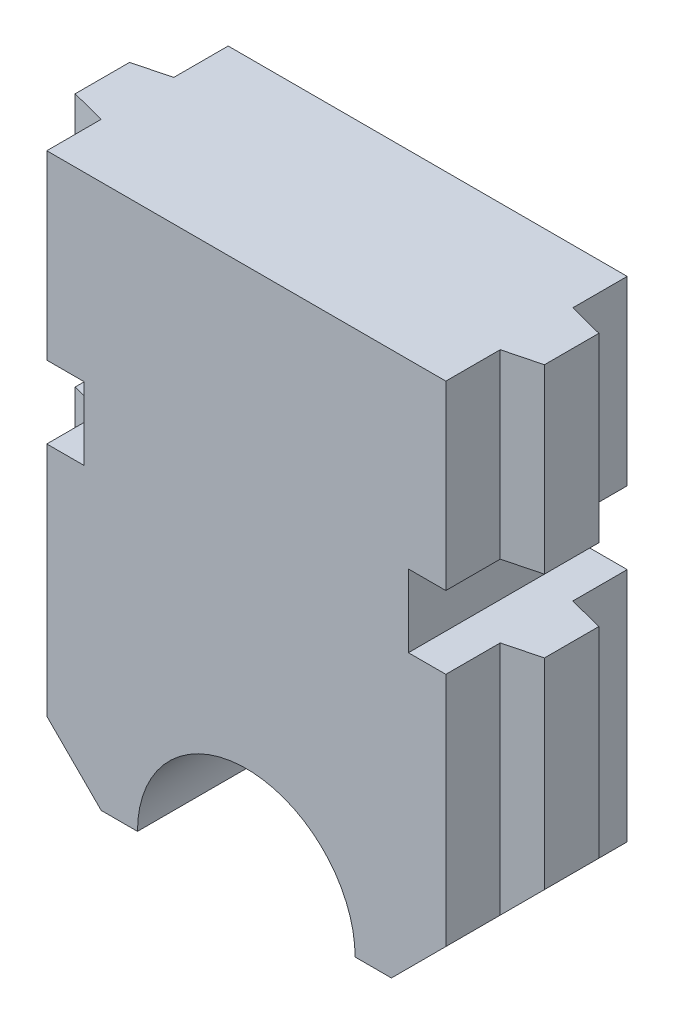
ISO-10303-21;
HEADER;
FILE_DESCRIPTION(('STEP AP214'),'2;1');
FILE_NAME('part.step','',(''),(''),'','','');
FILE_SCHEMA(('AUTOMOTIVE_DESIGN { 1 0 10303 214 1 1 1 1 }'));
ENDSEC;
DATA;
#1=APPLICATION_CONTEXT('core data for automotive mechanical design processes');
#2=APPLICATION_PROTOCOL_DEFINITION('international standard','automotive_design',2000,#1);
#3=PRODUCT_CONTEXT('',#1,'mechanical');
#4=PRODUCT('Part','Part','',(#3));
#5=PRODUCT_RELATED_PRODUCT_CATEGORY('part','',(#4));
#6=PRODUCT_DEFINITION_FORMATION('','',#4);
#7=PRODUCT_DEFINITION_CONTEXT('part definition',#1,'design');
#8=PRODUCT_DEFINITION('design','',#6,#7);
#9=PRODUCT_DEFINITION_SHAPE('','',#8);
#10=(LENGTH_UNIT() NAMED_UNIT(*) SI_UNIT(.MILLI.,.METRE.));
#11=(NAMED_UNIT(*) PLANE_ANGLE_UNIT() SI_UNIT($,.RADIAN.));
#12=(NAMED_UNIT(*) SI_UNIT($,.STERADIAN.) SOLID_ANGLE_UNIT());
#13=UNCERTAINTY_MEASURE_WITH_UNIT(LENGTH_MEASURE(1.E-05),#10,'distance_accuracy_value','');
#14=(GEOMETRIC_REPRESENTATION_CONTEXT(3) GLOBAL_UNCERTAINTY_ASSIGNED_CONTEXT((#13)) GLOBAL_UNIT_ASSIGNED_CONTEXT((#10,
#11,#12)) REPRESENTATION_CONTEXT('',''));
#15=CARTESIAN_POINT('',(0.,0.,0.));
#16=DIRECTION('',(0.,0.,1.));
#17=DIRECTION('',(1.,0.,0.));
#18=AXIS2_PLACEMENT_3D('',#15,#16,#17);
#19=CARTESIAN_POINT('',(-8.81841543215734,19.7048120212059,5.));
#20=DIRECTION('',(1.,0.,0.));
#21=DIRECTION('',(0.,0.,-1.));
#22=AXIS2_PLACEMENT_3D('',#19,#20,#21);
#23=PLANE('',#22);
#24=DIRECTION('',(0.,0.,-1.));
#25=VECTOR('',#24,1.);
#26=CARTESIAN_POINT('',(-8.81841543215734,12.7048120212059,5.));
#27=LINE('',#26,#25);
#28=CARTESIAN_POINT('',(-8.81841543215734,12.7048120212059,1.5));
#29=VERTEX_POINT('',#28);
#30=CARTESIAN_POINT('',(-8.81841543215734,12.7048120212059,0.));
#31=VERTEX_POINT('',#30);
#32=EDGE_CURVE('E281',#29,#31,#27,.T.);
#33=ORIENTED_EDGE('',*,*,#32,.F.);
#34=DIRECTION('',(0.,-1.,0.));
#35=VECTOR('',#34,1.);
#36=CARTESIAN_POINT('',(-8.81841543215734,19.7048120212059,1.5));
#37=LINE('',#36,#35);
#38=CARTESIAN_POINT('',(-8.81841543215734,6.2048120212059,1.5));
#39=VERTEX_POINT('',#38);
#40=EDGE_CURVE('E454',#29,#39,#37,.T.);
#41=ORIENTED_EDGE('',*,*,#40,.T.);
#42=DIRECTION('',(0.,0.,-1.));
#43=VECTOR('',#42,1.);
#44=CARTESIAN_POINT('',(-8.81841543215734,6.2048120212059,5.));
#45=LINE('',#44,#43);
#46=CARTESIAN_POINT('',(-8.81841543215734,6.2048120212059,0.));
#47=VERTEX_POINT('',#46);
#48=EDGE_CURVE('E447',#39,#47,#45,.T.);
#49=ORIENTED_EDGE('',*,*,#48,.T.);
#50=DIRECTION('',(0.,-1.,0.));
#51=VECTOR('',#50,1.);
#52=CARTESIAN_POINT('',(-8.81841543215734,19.7048120212059,0.));
#53=LINE('',#52,#51);
#54=EDGE_CURVE('E405',#31,#47,#53,.T.);
#55=ORIENTED_EDGE('',*,*,#54,.F.);
#56=EDGE_LOOP('',(#33,#41,#49,#55));
#57=FACE_BOUND('',#56,.T.);
#58=ADVANCED_FACE('F33',(#57),#23,.T.);
#59=DIRECTION('',(0.,0.,-1.));
#60=VECTOR('',#59,1.);
#61=CARTESIAN_POINT('',(-8.81841543215734,12.7048120212059,5.));
#62=LINE('',#61,#60);
#63=CARTESIAN_POINT('',(-8.81841543215734,12.7048120212059,5.));
#64=VERTEX_POINT('',#63);
#65=CARTESIAN_POINT('',(-8.81841543215734,12.7048120212059,3.5));
#66=VERTEX_POINT('',#65);
#67=EDGE_CURVE('E286',#64,#66,#62,.T.);
#68=ORIENTED_EDGE('',*,*,#67,.F.);
#69=DIRECTION('',(0.,-1.,0.));
#70=VECTOR('',#69,1.);
#71=CARTESIAN_POINT('',(-8.81841543215734,19.7048120212059,5.));
#72=LINE('',#71,#70);
#73=CARTESIAN_POINT('',(-8.81841543215734,6.2048120212059,5.));
#74=VERTEX_POINT('',#73);
#75=EDGE_CURVE('E265',#64,#74,#72,.T.);
#76=ORIENTED_EDGE('',*,*,#75,.T.);
#77=CARTESIAN_POINT('',(-8.81841543215733,6.2048120212059,3.5));
#78=VERTEX_POINT('',#77);
#79=EDGE_CURVE('E444',#74,#78,#45,.T.);
#80=ORIENTED_EDGE('',*,*,#79,.T.);
#81=DIRECTION('',(0.,-1.,0.));
#82=VECTOR('',#81,1.);
#83=CARTESIAN_POINT('',(-8.81841543215734,19.7048120212059,3.5));
#84=LINE('',#83,#82);
#85=EDGE_CURVE('E430',#66,#78,#84,.T.);
#86=ORIENTED_EDGE('',*,*,#85,.F.);
#87=EDGE_LOOP('',(#68,#76,#80,#86));
#88=FACE_BOUND('',#87,.T.);
#89=ADVANCED_FACE('F489',(#88),#23,.T.);
#90=CARTESIAN_POINT('',(-7.85016959560548,4.7048120212059,3.25));
#91=DIRECTION('',(1.,0.,0.));
#92=DIRECTION('',(0.,1.,0.));
#93=AXIS2_PLACEMENT_3D('',#90,#91,#92);
#94=PLANE('',#93);
#95=DIRECTION('',(0.,0.,1.));
#96=VECTOR('',#95,1.);
#97=CARTESIAN_POINT('',(-7.85016959560549,12.7048120212059,-10.));
#98=LINE('',#97,#96);
#99=CARTESIAN_POINT('',(-7.85016959560549,12.7048120212059,1.75));
#100=VERTEX_POINT('',#99);
#101=CARTESIAN_POINT('',(-7.85016959560549,12.7048120212059,3.25));
#102=VERTEX_POINT('',#101);
#103=EDGE_CURVE('E250',#100,#102,#98,.T.);
#104=ORIENTED_EDGE('',*,*,#103,.T.);
#105=DIRECTION('',(0.,1.,0.));
#106=VECTOR('',#105,1.);
#107=CARTESIAN_POINT('',(-7.85016959560548,4.7048120212059,3.25));
#108=LINE('',#107,#106);
#109=CARTESIAN_POINT('',(-7.85016959560548,7.17305785775777,3.25));
#110=VERTEX_POINT('',#109);
#111=EDGE_CURVE('E355',#110,#102,#108,.T.);
#112=ORIENTED_EDGE('',*,*,#111,.F.);
#113=DIRECTION('',(0.,0.,1.));
#114=VECTOR('',#113,1.);
#115=CARTESIAN_POINT('',(-7.85016959560548,7.17305785775777,-10.));
#116=LINE('',#115,#114);
#117=CARTESIAN_POINT('',(-7.85016959560548,7.17305785775777,1.75));
#118=VERTEX_POINT('',#117);
#119=EDGE_CURVE('E324',#118,#110,#116,.T.);
#120=ORIENTED_EDGE('',*,*,#119,.F.);
#121=DIRECTION('',(0.,1.,0.));
#122=VECTOR('',#121,1.);
#123=CARTESIAN_POINT('',(-7.85016959560548,4.7048120212059,1.75));
#124=LINE('',#123,#122);
#125=EDGE_CURVE('E359',#118,#100,#124,.T.);
#126=ORIENTED_EDGE('',*,*,#125,.T.);
#127=EDGE_LOOP('',(#104,#112,#120,#126));
#128=FACE_BOUND('',#127,.T.);
#129=ADVANCED_FACE('F477',(#128),#94,.T.);
#130=CARTESIAN_POINT('',(-8.81841543215733,4.7048120212059,3.5));
#131=DIRECTION('',(0.25,0.,0.968245836551854));
#132=DIRECTION('',(0.968245836551854,0.,-0.25));
#133=AXIS2_PLACEMENT_3D('',#130,#131,#132);
#134=PLANE('',#133);
#135=DIRECTION('',(0.968245836551854,0.,-0.25));
#136=VECTOR('',#135,1.);
#137=CARTESIAN_POINT('',(-8.81841543215733,12.7048120212059,3.5));
#138=LINE('',#137,#136);
#139=EDGE_CURVE('E284',#66,#102,#138,.T.);
#140=ORIENTED_EDGE('',*,*,#139,.F.);
#141=ORIENTED_EDGE('',*,*,#85,.T.);
#142=DIRECTION('',(-0.695608343640251,-0.695608343640253,0.179605302026775));
#143=VECTOR('',#142,1.);
#144=CARTESIAN_POINT('',(-9.54422188377024,5.479005569593,3.68740241997778));
#145=LINE('',#144,#143);
#146=EDGE_CURVE('E330',#110,#78,#145,.T.);
#147=ORIENTED_EDGE('',*,*,#146,.F.);
#148=ORIENTED_EDGE('',*,*,#111,.T.);
#149=EDGE_LOOP('',(#140,#141,#147,#148));
#150=FACE_BOUND('',#149,.T.);
#151=ADVANCED_FACE('F486',(#150),#134,.T.);
#152=CARTESIAN_POINT('',(-8.81841543215733,4.7048120212059,1.5));
#153=DIRECTION('',(-0.25,0.,0.968245836551854));
#154=DIRECTION('',(0.968245836551854,0.,0.25));
#155=AXIS2_PLACEMENT_3D('',#152,#153,#154);
#156=PLANE('',#155);
#157=ORIENTED_EDGE('',*,*,#40,.F.);
#158=DIRECTION('',(0.968245836551854,0.,0.25));
#159=VECTOR('',#158,1.);
#160=CARTESIAN_POINT('',(-8.81841543215733,12.7048120212059,1.5));
#161=LINE('',#160,#159);
#162=EDGE_CURVE('E41',#29,#100,#161,.T.);
#163=ORIENTED_EDGE('',*,*,#162,.T.);
#164=ORIENTED_EDGE('',*,*,#125,.F.);
#165=DIRECTION('',(-0.695608343640251,-0.695608343640253,-0.179605302026775));
#166=VECTOR('',#165,1.);
#167=CARTESIAN_POINT('',(-9.54422188377024,5.479005569593,1.31259758002222));
#168=LINE('',#167,#166);
#169=EDGE_CURVE('E333',#118,#39,#168,.T.);
#170=ORIENTED_EDGE('',*,*,#169,.T.);
#171=EDGE_LOOP('',(#157,#163,#164,#170));
#172=FACE_BOUND('',#171,.T.);
#173=ADVANCED_FACE('F473',(#172),#156,.F.);
#174=CARTESIAN_POINT('',(-19.8184154321573,19.7048120212059,5.));
#175=DIRECTION('',(1.,0.,0.));
#176=DIRECTION('',(0.,0.,-1.));
#177=AXIS2_PLACEMENT_3D('',#174,#175,#176);
#178=PLANE('',#177);
#179=DIRECTION('',(0.,0.,-1.));
#180=VECTOR('',#179,1.);
#181=CARTESIAN_POINT('',(-19.8184154321573,14.7048120212059,5.));
#182=LINE('',#181,#180);
#183=CARTESIAN_POINT('',(-19.8184154321573,14.7048120212059,5.));
#184=VERTEX_POINT('',#183);
#185=CARTESIAN_POINT('',(-19.8184154321573,14.7048120212059,3.5));
#186=VERTEX_POINT('',#185);
#187=EDGE_CURVE('E321',#184,#186,#182,.T.);
#188=ORIENTED_EDGE('',*,*,#187,.F.);
#189=DIRECTION('',(0.,-1.,0.));
#190=VECTOR('',#189,1.);
#191=CARTESIAN_POINT('',(-19.8184154321573,19.7048120212059,5.));
#192=LINE('',#191,#190);
#193=CARTESIAN_POINT('',(-19.8184154321573,19.7048120212059,5.));
#194=VERTEX_POINT('',#193);
#195=EDGE_CURVE('E399',#194,#184,#192,.T.);
#196=ORIENTED_EDGE('',*,*,#195,.F.);
#197=DIRECTION('',(0.,0.,-1.));
#198=VECTOR('',#197,1.);
#199=CARTESIAN_POINT('',(-19.8184154321573,19.7048120212059,5.));
#200=LINE('',#199,#198);
#201=CARTESIAN_POINT('',(-19.8184154321573,19.7048120212059,3.5));
#202=VERTEX_POINT('',#201);
#203=EDGE_CURVE('E427',#194,#202,#200,.T.);
#204=ORIENTED_EDGE('',*,*,#203,.T.);
#205=DIRECTION('',(0.,1.,0.));
#206=VECTOR('',#205,1.);
#207=CARTESIAN_POINT('',(-19.8184154321573,4.7048120212059,3.5));
#208=LINE('',#207,#206);
#209=EDGE_CURVE('E374',#186,#202,#208,.T.);
#210=ORIENTED_EDGE('',*,*,#209,.F.);
#211=EDGE_LOOP('',(#188,#196,#204,#210));
#212=FACE_BOUND('',#211,.T.);
#213=ADVANCED_FACE('F556',(#212),#178,.F.);
#214=DIRECTION('',(0.,0.,1.));
#215=VECTOR('',#214,1.);
#216=CARTESIAN_POINT('',(-19.8184154321573,12.7048120212059,5.));
#217=LINE('',#216,#215);
#218=CARTESIAN_POINT('',(-19.8184154321573,12.7048120212059,3.5));
#219=VERTEX_POINT('',#218);
#220=CARTESIAN_POINT('',(-19.8184154321573,12.7048120212059,5.));
#221=VERTEX_POINT('',#220);
#222=EDGE_CURVE('E312',#219,#221,#217,.T.);
#223=ORIENTED_EDGE('',*,*,#222,.F.);
#224=CARTESIAN_POINT('',(-19.8184154321573,6.20481202120588,3.5));
#225=VERTEX_POINT('',#224);
#226=EDGE_CURVE('E375',#225,#219,#208,.T.);
#227=ORIENTED_EDGE('',*,*,#226,.F.);
#228=DIRECTION('',(0.,0.,-1.));
#229=VECTOR('',#228,1.);
#230=CARTESIAN_POINT('',(-19.8184154321573,6.2048120212059,5.));
#231=LINE('',#230,#229);
#232=CARTESIAN_POINT('',(-19.8184154321573,6.2048120212059,5.));
#233=VERTEX_POINT('',#232);
#234=EDGE_CURVE('E432',#233,#225,#231,.T.);
#235=ORIENTED_EDGE('',*,*,#234,.F.);
#236=EDGE_CURVE('E398',#221,#233,#192,.T.);
#237=ORIENTED_EDGE('',*,*,#236,.F.);
#238=EDGE_LOOP('',(#223,#227,#235,#237));
#239=FACE_BOUND('',#238,.T.);
#240=ADVANCED_FACE('F571',(#239),#178,.F.);
#241=DIRECTION('',(0.,0.,-1.));
#242=VECTOR('',#241,1.);
#243=CARTESIAN_POINT('',(-19.8184154321573,14.7048120212059,5.));
#244=LINE('',#243,#242);
#245=CARTESIAN_POINT('',(-19.8184154321573,14.7048120212059,1.5));
#246=VERTEX_POINT('',#245);
#247=CARTESIAN_POINT('',(-19.8184154321573,14.7048120212059,0.));
#248=VERTEX_POINT('',#247);
#249=EDGE_CURVE('E314',#246,#248,#244,.T.);
#250=ORIENTED_EDGE('',*,*,#249,.F.);
#251=DIRECTION('',(0.,1.,0.));
#252=VECTOR('',#251,1.);
#253=CARTESIAN_POINT('',(-19.8184154321573,4.7048120212059,1.5));
#254=LINE('',#253,#252);
#255=CARTESIAN_POINT('',(-19.8184154321573,19.7048120212059,1.5));
#256=VERTEX_POINT('',#255);
#257=EDGE_CURVE('E362',#246,#256,#254,.T.);
#258=ORIENTED_EDGE('',*,*,#257,.T.);
#259=CARTESIAN_POINT('',(-19.8184154321573,19.7048120212059,0.));
#260=VERTEX_POINT('',#259);
#261=EDGE_CURVE('E431',#256,#260,#200,.T.);
#262=ORIENTED_EDGE('',*,*,#261,.T.);
#263=DIRECTION('',(0.,-1.,0.));
#264=VECTOR('',#263,1.);
#265=CARTESIAN_POINT('',(-19.8184154321573,19.7048120212059,0.));
#266=LINE('',#265,#264);
#267=EDGE_CURVE('E382',#260,#248,#266,.T.);
#268=ORIENTED_EDGE('',*,*,#267,.T.);
#269=EDGE_LOOP('',(#250,#258,#262,#268));
#270=FACE_BOUND('',#269,.T.);
#271=ADVANCED_FACE('F659',(#270),#178,.F.);
#272=DIRECTION('',(0.,0.,1.));
#273=VECTOR('',#272,1.);
#274=CARTESIAN_POINT('',(-19.8184154321573,12.7048120212059,5.));
#275=LINE('',#274,#273);
#276=CARTESIAN_POINT('',(-19.8184154321573,12.7048120212059,0.));
#277=VERTEX_POINT('',#276);
#278=CARTESIAN_POINT('',(-19.8184154321573,12.7048120212059,1.5));
#279=VERTEX_POINT('',#278);
#280=EDGE_CURVE('E56',#277,#279,#275,.T.);
#281=ORIENTED_EDGE('',*,*,#280,.F.);
#282=CARTESIAN_POINT('',(-19.8184154321573,6.2048120212059,0.));
#283=VERTEX_POINT('',#282);
#284=EDGE_CURVE('E424',#277,#283,#266,.T.);
#285=ORIENTED_EDGE('',*,*,#284,.T.);
#286=CARTESIAN_POINT('',(-19.8184154321573,6.20481202120588,1.5));
#287=VERTEX_POINT('',#286);
#288=EDGE_CURVE('E435',#287,#283,#231,.T.);
#289=ORIENTED_EDGE('',*,*,#288,.F.);
#290=EDGE_CURVE('E363',#287,#279,#254,.T.);
#291=ORIENTED_EDGE('',*,*,#290,.T.);
#292=EDGE_LOOP('',(#281,#285,#289,#291));
#293=FACE_BOUND('',#292,.T.);
#294=ADVANCED_FACE('F589',(#293),#178,.F.);
#295=CARTESIAN_POINT('',(-14.3184154321573,4.7048120212059,5.));
#296=DIRECTION('',(0.,0.,-1.));
#297=DIRECTION('',(-1.,0.,0.));
#298=AXIS2_PLACEMENT_3D('',#295,#296,#297);
#299=PLANE('',#298);
#300=ORIENTED_EDGE('',*,*,#75,.F.);
#301=DIRECTION('',(1.,0.,0.));
#302=VECTOR('',#301,1.);
#303=CARTESIAN_POINT('',(-9.85016959560549,12.7048120212059,5.));
#304=LINE('',#303,#302);
#305=CARTESIAN_POINT('',(-9.85016959560549,12.7048120212059,5.));
#306=VERTEX_POINT('',#305);
#307=EDGE_CURVE('E244',#306,#64,#304,.T.);
#308=ORIENTED_EDGE('',*,*,#307,.F.);
#309=DIRECTION('',(0.,-1.,0.));
#310=VECTOR('',#309,1.);
#311=CARTESIAN_POINT('',(-9.85016959560549,14.7048120212059,5.));
#312=LINE('',#311,#310);
#313=CARTESIAN_POINT('',(-9.85016959560549,14.7048120212059,5.));
#314=VERTEX_POINT('',#313);
#315=EDGE_CURVE('E254',#314,#306,#312,.T.);
#316=ORIENTED_EDGE('',*,*,#315,.F.);
#317=DIRECTION('',(-1.,0.,0.));
#318=VECTOR('',#317,1.);
#319=CARTESIAN_POINT('',(-7.85016959560549,14.7048120212059,5.));
#320=LINE('',#319,#318);
#321=CARTESIAN_POINT('',(-8.81841543215734,14.7048120212059,5.));
#322=VERTEX_POINT('',#321);
#323=EDGE_CURVE('E260',#322,#314,#320,.T.);
#324=ORIENTED_EDGE('',*,*,#323,.F.);
#325=CARTESIAN_POINT('',(-8.81841543215734,19.7048120212059,5.));
#326=VERTEX_POINT('',#325);
#327=EDGE_CURVE('E383',#326,#322,#72,.T.);
#328=ORIENTED_EDGE('',*,*,#327,.F.);
#329=DIRECTION('',(1.,0.,0.));
#330=VECTOR('',#329,1.);
#331=CARTESIAN_POINT('',(-19.8184154321573,19.7048120212059,5.));
#332=LINE('',#331,#330);
#333=EDGE_CURVE('E379',#194,#326,#332,.T.);
#334=ORIENTED_EDGE('',*,*,#333,.F.);
#335=ORIENTED_EDGE('',*,*,#195,.T.);
#336=DIRECTION('',(1.,0.,0.));
#337=VECTOR('',#336,1.);
#338=CARTESIAN_POINT('',(-20.7866612687092,14.7048120212059,5.));
#339=LINE('',#338,#337);
#340=CARTESIAN_POINT('',(-18.7866612687092,14.7048120212059,5.));
#341=VERTEX_POINT('',#340);
#342=EDGE_CURVE('E288',#184,#341,#339,.T.);
#343=ORIENTED_EDGE('',*,*,#342,.T.);
#344=DIRECTION('',(0.,-1.,0.));
#345=VECTOR('',#344,1.);
#346=CARTESIAN_POINT('',(-18.7866612687092,14.7048120212059,5.));
#347=LINE('',#346,#345);
#348=CARTESIAN_POINT('',(-18.7866612687092,12.7048120212059,5.));
#349=VERTEX_POINT('',#348);
#350=EDGE_CURVE('E291',#341,#349,#347,.T.);
#351=ORIENTED_EDGE('',*,*,#350,.T.);
#352=DIRECTION('',(-1.,0.,0.));
#353=VECTOR('',#352,1.);
#354=CARTESIAN_POINT('',(-18.7866612687092,12.7048120212059,5.));
#355=LINE('',#354,#353);
#356=EDGE_CURVE('E294',#349,#221,#355,.T.);
#357=ORIENTED_EDGE('',*,*,#356,.T.);
#358=ORIENTED_EDGE('',*,*,#236,.T.);
#359=DIRECTION('',(0.707106781186549,-0.707106781186546,0.));
#360=VECTOR('',#359,1.);
#361=CARTESIAN_POINT('',(-19.8184154321573,6.2048120212059,5.));
#362=LINE('',#361,#360);
#363=CARTESIAN_POINT('',(-18.3184154321573,4.7048120212059,5.));
#364=VERTEX_POINT('',#363);
#365=EDGE_CURVE('E396',#233,#364,#362,.T.);
#366=ORIENTED_EDGE('',*,*,#365,.T.);
#367=DIRECTION('',(1.,0.,0.));
#368=VECTOR('',#367,1.);
#369=CARTESIAN_POINT('',(-18.3184154321573,4.7048120212059,5.));
#370=LINE('',#369,#368);
#371=CARTESIAN_POINT('',(-17.3184154321573,4.7048120212059,5.));
#372=VERTEX_POINT('',#371);
#373=EDGE_CURVE('E394',#364,#372,#370,.T.);
#374=ORIENTED_EDGE('',*,*,#373,.T.);
#375=CARTESIAN_POINT('',(-14.3184154321573,4.7048120212059,5.));
#376=DIRECTION('',(0.,0.,-1.));
#377=DIRECTION('',(-1.,0.,0.));
#378=AXIS2_PLACEMENT_3D('',#375,#376,#377);
#379=CIRCLE('',#378,3.);
#380=CARTESIAN_POINT('',(-11.3184154321573,4.7048120212059,5.));
#381=VERTEX_POINT('',#380);
#382=EDGE_CURVE('E392',#372,#381,#379,.T.);
#383=ORIENTED_EDGE('',*,*,#382,.T.);
#384=DIRECTION('',(-1.,0.,0.));
#385=VECTOR('',#384,1.);
#386=CARTESIAN_POINT('',(-10.3184154321573,4.7048120212059,5.));
#387=LINE('',#386,#385);
#388=CARTESIAN_POINT('',(-10.3184154321573,4.7048120212059,5.));
#389=VERTEX_POINT('',#388);
#390=EDGE_CURVE('E389',#389,#381,#387,.T.);
#391=ORIENTED_EDGE('',*,*,#390,.F.);
#392=DIRECTION('',(-0.707106781186548,-0.707106781186548,0.));
#393=VECTOR('',#392,1.);
#394=CARTESIAN_POINT('',(-8.81841543215734,6.2048120212059,5.));
#395=LINE('',#394,#393);
#396=EDGE_CURVE('E386',#74,#389,#395,.T.);
#397=ORIENTED_EDGE('',*,*,#396,.F.);
#398=EDGE_LOOP('',(#300,#308,#316,#324,#328,#334,#335,#343,#351,#357,#358,#366,#374,#383,#391,#397));
#399=FACE_BOUND('',#398,.T.);
#400=ADVANCED_FACE('F263',(#399),#299,.F.);
#401=CARTESIAN_POINT('',(-14.3184154321573,4.7048120212059,0.));
#402=DIRECTION('',(0.,0.,-1.));
#403=DIRECTION('',(-1.,0.,0.));
#404=AXIS2_PLACEMENT_3D('',#401,#402,#403);
#405=PLANE('',#404);
#406=DIRECTION('',(-1.,0.,0.));
#407=VECTOR('',#406,1.);
#408=CARTESIAN_POINT('',(-14.3184154321573,12.7048120212059,0.));
#409=LINE('',#408,#407);
#410=CARTESIAN_POINT('',(-9.85016959560549,12.7048120212059,0.));
#411=VERTEX_POINT('',#410);
#412=EDGE_CURVE('E247',#31,#411,#409,.T.);
#413=ORIENTED_EDGE('',*,*,#412,.F.);
#414=ORIENTED_EDGE('',*,*,#54,.T.);
#415=DIRECTION('',(-0.707106781186548,-0.707106781186548,0.));
#416=VECTOR('',#415,1.);
#417=CARTESIAN_POINT('',(-8.81841543215734,6.2048120212059,0.));
#418=LINE('',#417,#416);
#419=CARTESIAN_POINT('',(-10.3184154321573,4.7048120212059,0.));
#420=VERTEX_POINT('',#419);
#421=EDGE_CURVE('E409',#47,#420,#418,.T.);
#422=ORIENTED_EDGE('',*,*,#421,.T.);
#423=DIRECTION('',(-1.,0.,0.));
#424=VECTOR('',#423,1.);
#425=CARTESIAN_POINT('',(-10.3184154321573,4.7048120212059,0.));
#426=LINE('',#425,#424);
#427=CARTESIAN_POINT('',(-11.3184154321573,4.7048120212059,0.));
#428=VERTEX_POINT('',#427);
#429=EDGE_CURVE('E412',#420,#428,#426,.T.);
#430=ORIENTED_EDGE('',*,*,#429,.T.);
#431=CARTESIAN_POINT('',(-14.3184154321573,4.7048120212059,0.));
#432=DIRECTION('',(0.,0.,-1.));
#433=DIRECTION('',(-1.,0.,0.));
#434=AXIS2_PLACEMENT_3D('',#431,#432,#433);
#435=CIRCLE('',#434,3.);
#436=CARTESIAN_POINT('',(-17.3184154321573,4.7048120212059,0.));
#437=VERTEX_POINT('',#436);
#438=EDGE_CURVE('E415',#437,#428,#435,.T.);
#439=ORIENTED_EDGE('',*,*,#438,.F.);
#440=DIRECTION('',(1.,0.,0.));
#441=VECTOR('',#440,1.);
#442=CARTESIAN_POINT('',(-18.3184154321573,4.7048120212059,0.));
#443=LINE('',#442,#441);
#444=CARTESIAN_POINT('',(-18.3184154321573,4.7048120212059,0.));
#445=VERTEX_POINT('',#444);
#446=EDGE_CURVE('E418',#445,#437,#443,.T.);
#447=ORIENTED_EDGE('',*,*,#446,.F.);
#448=DIRECTION('',(0.707106781186549,-0.707106781186546,0.));
#449=VECTOR('',#448,1.);
#450=CARTESIAN_POINT('',(-19.8184154321573,6.2048120212059,0.));
#451=LINE('',#450,#449);
#452=EDGE_CURVE('E421',#283,#445,#451,.T.);
#453=ORIENTED_EDGE('',*,*,#452,.F.);
#454=ORIENTED_EDGE('',*,*,#284,.F.);
#455=DIRECTION('',(1.,0.,0.));
#456=VECTOR('',#455,1.);
#457=CARTESIAN_POINT('',(-14.3184154321573,12.7048120212059,0.));
#458=LINE('',#457,#456);
#459=CARTESIAN_POINT('',(-18.7866612687092,12.7048120212059,0.));
#460=VERTEX_POINT('',#459);
#461=EDGE_CURVE('E307',#277,#460,#458,.T.);
#462=ORIENTED_EDGE('',*,*,#461,.T.);
#463=DIRECTION('',(0.,1.,0.));
#464=VECTOR('',#463,1.);
#465=CARTESIAN_POINT('',(-18.7866612687092,4.7048120212059,0.));
#466=LINE('',#465,#464);
#467=CARTESIAN_POINT('',(-18.7866612687092,14.7048120212059,0.));
#468=VERTEX_POINT('',#467);
#469=EDGE_CURVE('E465',#460,#468,#466,.T.);
#470=ORIENTED_EDGE('',*,*,#469,.T.);
#471=DIRECTION('',(-1.,0.,0.));
#472=VECTOR('',#471,1.);
#473=CARTESIAN_POINT('',(-14.3184154321573,14.7048120212059,0.));
#474=LINE('',#473,#472);
#475=EDGE_CURVE('E316',#468,#248,#474,.T.);
#476=ORIENTED_EDGE('',*,*,#475,.T.);
#477=ORIENTED_EDGE('',*,*,#267,.F.);
#478=DIRECTION('',(1.,0.,0.));
#479=VECTOR('',#478,1.);
#480=CARTESIAN_POINT('',(-19.8184154321573,19.7048120212059,0.));
#481=LINE('',#480,#479);
#482=CARTESIAN_POINT('',(-8.81841543215734,19.7048120212059,0.));
#483=VERTEX_POINT('',#482);
#484=EDGE_CURVE('E378',#260,#483,#481,.T.);
#485=ORIENTED_EDGE('',*,*,#484,.T.);
#486=CARTESIAN_POINT('',(-8.81841543215734,14.7048120212059,0.));
#487=VERTEX_POINT('',#486);
#488=EDGE_CURVE('E406',#483,#487,#53,.T.);
#489=ORIENTED_EDGE('',*,*,#488,.T.);
#490=DIRECTION('',(1.,0.,0.));
#491=VECTOR('',#490,1.);
#492=CARTESIAN_POINT('',(-14.3184154321573,14.7048120212059,0.));
#493=LINE('',#492,#491);
#494=CARTESIAN_POINT('',(-9.85016959560549,14.7048120212059,0.));
#495=VERTEX_POINT('',#494);
#496=EDGE_CURVE('E275',#495,#487,#493,.T.);
#497=ORIENTED_EDGE('',*,*,#496,.F.);
#498=DIRECTION('',(0.,1.,0.));
#499=VECTOR('',#498,1.);
#500=CARTESIAN_POINT('',(-9.85016959560549,4.7048120212059,0.));
#501=LINE('',#500,#499);
#502=EDGE_CURVE('E11',#411,#495,#501,.T.);
#503=ORIENTED_EDGE('',*,*,#502,.F.);
#504=EDGE_LOOP('',(#413,#414,#422,#430,#439,#447,#453,#454,#462,#470,#476,#477,#485,#489,#497,#503));
#505=FACE_BOUND('',#504,.T.);
#506=ADVANCED_FACE('F499',(#505),#405,.T.);
#507=CARTESIAN_POINT('',(-19.8184154321573,4.7048120212059,3.5));
#508=DIRECTION('',(0.25,0.,-0.968245836551854));
#509=DIRECTION('',(-0.968245836551854,0.,-0.25));
#510=AXIS2_PLACEMENT_3D('',#507,#508,#509);
#511=PLANE('',#510);
#512=DIRECTION('',(-0.968245836551854,0.,-0.25));
#513=VECTOR('',#512,1.);
#514=CARTESIAN_POINT('',(-19.8184154321573,14.7048120212059,3.5));
#515=LINE('',#514,#513);
#516=CARTESIAN_POINT('',(-20.7866612687092,14.7048120212059,3.25));
#517=VERTEX_POINT('',#516);
#518=EDGE_CURVE('E319',#186,#517,#515,.T.);
#519=ORIENTED_EDGE('',*,*,#518,.F.);
#520=ORIENTED_EDGE('',*,*,#209,.T.);
#521=DIRECTION('',(-0.968245836551854,0.,-0.25));
#522=VECTOR('',#521,1.);
#523=CARTESIAN_POINT('',(-19.8184154321573,19.7048120212059,3.5));
#524=LINE('',#523,#522);
#525=CARTESIAN_POINT('',(-20.7866612687092,19.7048120212059,3.25));
#526=VERTEX_POINT('',#525);
#527=EDGE_CURVE('E336',#202,#526,#524,.T.);
#528=ORIENTED_EDGE('',*,*,#527,.T.);
#529=DIRECTION('',(0.,1.,0.));
#530=VECTOR('',#529,1.);
#531=CARTESIAN_POINT('',(-20.7866612687092,4.7048120212059,3.25));
#532=LINE('',#531,#530);
#533=EDGE_CURVE('E370',#517,#526,#532,.T.);
#534=ORIENTED_EDGE('',*,*,#533,.F.);
#535=EDGE_LOOP('',(#519,#520,#528,#534));
#536=FACE_BOUND('',#535,.T.);
#537=ADVANCED_FACE('F602',(#536),#511,.F.);
#538=DIRECTION('',(0.968245836551854,0.,0.25));
#539=VECTOR('',#538,1.);
#540=CARTESIAN_POINT('',(-19.8184154321573,12.7048120212059,3.5));
#541=LINE('',#540,#539);
#542=CARTESIAN_POINT('',(-20.7866612687092,12.7048120212059,3.25));
#543=VERTEX_POINT('',#542);
#544=EDGE_CURVE('E310',#543,#219,#541,.T.);
#545=ORIENTED_EDGE('',*,*,#544,.F.);
#546=CARTESIAN_POINT('',(-20.7866612687092,7.17305785775773,3.25));
#547=VERTEX_POINT('',#546);
#548=EDGE_CURVE('E371',#547,#543,#532,.T.);
#549=ORIENTED_EDGE('',*,*,#548,.F.);
#550=DIRECTION('',(0.695608343640256,-0.695608343640249,0.179605302026776));
#551=VECTOR('',#550,1.);
#552=CARTESIAN_POINT('',(-19.0926089805444,5.479005569593,3.68740241997778));
#553=LINE('',#552,#551);
#554=EDGE_CURVE('E326',#547,#225,#553,.T.);
#555=ORIENTED_EDGE('',*,*,#554,.T.);
#556=ORIENTED_EDGE('',*,*,#226,.T.);
#557=EDGE_LOOP('',(#545,#549,#555,#556));
#558=FACE_BOUND('',#557,.T.);
#559=ADVANCED_FACE('F599',(#558),#511,.F.);
#560=CARTESIAN_POINT('',(-20.7866612687092,4.7048120212059,3.25));
#561=DIRECTION('',(1.,0.,0.));
#562=DIRECTION('',(0.,1.,0.));
#563=AXIS2_PLACEMENT_3D('',#560,#561,#562);
#564=PLANE('',#563);
#565=DIRECTION('',(0.,0.,1.));
#566=VECTOR('',#565,1.);
#567=CARTESIAN_POINT('',(-20.7866612687092,14.7048120212059,-10.));
#568=LINE('',#567,#566);
#569=CARTESIAN_POINT('',(-20.7866612687092,14.7048120212059,1.75));
#570=VERTEX_POINT('',#569);
#571=EDGE_CURVE('E303',#570,#517,#568,.T.);
#572=ORIENTED_EDGE('',*,*,#571,.T.);
#573=ORIENTED_EDGE('',*,*,#533,.T.);
#574=DIRECTION('',(0.,0.,-1.));
#575=VECTOR('',#574,1.);
#576=CARTESIAN_POINT('',(-20.7866612687092,19.7048120212059,3.25));
#577=LINE('',#576,#575);
#578=CARTESIAN_POINT('',(-20.7866612687092,19.7048120212059,1.75));
#579=VERTEX_POINT('',#578);
#580=EDGE_CURVE('E339',#526,#579,#577,.T.);
#581=ORIENTED_EDGE('',*,*,#580,.T.);
#582=DIRECTION('',(0.,1.,0.));
#583=VECTOR('',#582,1.);
#584=CARTESIAN_POINT('',(-20.7866612687092,4.7048120212059,1.75));
#585=LINE('',#584,#583);
#586=EDGE_CURVE('E366',#570,#579,#585,.T.);
#587=ORIENTED_EDGE('',*,*,#586,.F.);
#588=EDGE_LOOP('',(#572,#573,#581,#587));
#589=FACE_BOUND('',#588,.T.);
#590=ADVANCED_FACE('F601',(#589),#564,.F.);
#591=DIRECTION('',(0.,0.,1.));
#592=VECTOR('',#591,1.);
#593=CARTESIAN_POINT('',(-20.7866612687092,12.7048120212059,-10.));
#594=LINE('',#593,#592);
#595=CARTESIAN_POINT('',(-20.7866612687092,12.7048120212059,1.75));
#596=VERTEX_POINT('',#595);
#597=EDGE_CURVE('E297',#596,#543,#594,.T.);
#598=ORIENTED_EDGE('',*,*,#597,.F.);
#599=CARTESIAN_POINT('',(-20.7866612687092,7.17305785775773,1.75));
#600=VERTEX_POINT('',#599);
#601=EDGE_CURVE('E367',#600,#596,#585,.T.);
#602=ORIENTED_EDGE('',*,*,#601,.F.);
#603=DIRECTION('',(0.,0.,1.));
#604=VECTOR('',#603,1.);
#605=CARTESIAN_POINT('',(-20.7866612687092,7.17305785775773,-10.));
#606=LINE('',#605,#604);
#607=EDGE_CURVE('E323',#600,#547,#606,.T.);
#608=ORIENTED_EDGE('',*,*,#607,.T.);
#609=ORIENTED_EDGE('',*,*,#548,.T.);
#610=EDGE_LOOP('',(#598,#602,#608,#609));
#611=FACE_BOUND('',#610,.T.);
#612=ADVANCED_FACE('F596',(#611),#564,.F.);
#613=CARTESIAN_POINT('',(-19.8184154321573,4.7048120212059,1.5));
#614=DIRECTION('',(-0.25,0.,-0.968245836551854));
#615=DIRECTION('',(-0.968245836551854,0.,0.25));
#616=AXIS2_PLACEMENT_3D('',#613,#614,#615);
#617=PLANE('',#616);
#618=ORIENTED_EDGE('',*,*,#257,.F.);
#619=DIRECTION('',(-0.968245836551854,0.,0.25));
#620=VECTOR('',#619,1.);
#621=CARTESIAN_POINT('',(-19.8184154321573,14.7048120212059,1.5));
#622=LINE('',#621,#620);
#623=EDGE_CURVE('E462',#246,#570,#622,.T.);
#624=ORIENTED_EDGE('',*,*,#623,.T.);
#625=ORIENTED_EDGE('',*,*,#586,.T.);
#626=DIRECTION('',(-0.968245836551854,0.,0.25));
#627=VECTOR('',#626,1.);
#628=CARTESIAN_POINT('',(-19.8184154321573,19.7048120212059,1.5));
#629=LINE('',#628,#627);
#630=EDGE_CURVE('E342',#256,#579,#629,.T.);
#631=ORIENTED_EDGE('',*,*,#630,.F.);
#632=EDGE_LOOP('',(#618,#624,#625,#631));
#633=FACE_BOUND('',#632,.T.);
#634=ADVANCED_FACE('F700',(#633),#617,.T.);
#635=ORIENTED_EDGE('',*,*,#601,.T.);
#636=DIRECTION('',(0.968245836551854,0.,-0.25));
#637=VECTOR('',#636,1.);
#638=CARTESIAN_POINT('',(-19.8184154321573,12.7048120212059,1.5));
#639=LINE('',#638,#637);
#640=EDGE_CURVE('E460',#596,#279,#639,.T.);
#641=ORIENTED_EDGE('',*,*,#640,.T.);
#642=ORIENTED_EDGE('',*,*,#290,.F.);
#643=DIRECTION('',(0.695608343640256,-0.695608343640249,-0.179605302026776));
#644=VECTOR('',#643,1.);
#645=CARTESIAN_POINT('',(-19.0926089805444,5.479005569593,1.31259758002222));
#646=LINE('',#645,#644);
#647=EDGE_CURVE('E458',#600,#287,#646,.T.);
#648=ORIENTED_EDGE('',*,*,#647,.F.);
#649=EDGE_LOOP('',(#635,#641,#642,#648));
#650=FACE_BOUND('',#649,.T.);
#651=ADVANCED_FACE('F591',(#650),#617,.T.);
#652=CARTESIAN_POINT('',(-18.3184154321573,4.7048120212059,5.));
#653=DIRECTION('',(0.,1.,0.));
#654=DIRECTION('',(-1.,0.,0.));
#655=AXIS2_PLACEMENT_3D('',#652,#653,#654);
#656=PLANE('',#655);
#657=ORIENTED_EDGE('',*,*,#446,.T.);
#658=DIRECTION('',(0.,0.,-1.));
#659=VECTOR('',#658,1.);
#660=CARTESIAN_POINT('',(-17.3184154321573,4.7048120212059,5.));
#661=LINE('',#660,#659);
#662=EDGE_CURVE('E438',#372,#437,#661,.T.);
#663=ORIENTED_EDGE('',*,*,#662,.F.);
#664=ORIENTED_EDGE('',*,*,#373,.F.);
#665=DIRECTION('',(0.,0.,-1.));
#666=VECTOR('',#665,1.);
#667=CARTESIAN_POINT('',(-18.3184154321573,4.7048120212059,5.));
#668=LINE('',#667,#666);
#669=EDGE_CURVE('E436',#364,#445,#668,.T.);
#670=ORIENTED_EDGE('',*,*,#669,.T.);
#671=EDGE_LOOP('',(#657,#663,#664,#670));
#672=FACE_BOUND('',#671,.T.);
#673=ADVANCED_FACE('F521',(#672),#656,.F.);
#674=CARTESIAN_POINT('',(-19.8184154321573,6.2048120212059,5.));
#675=DIRECTION('',(0.707106781186546,0.707106781186549,0.));
#676=DIRECTION('',(-0.707106781186549,0.707106781186546,0.));
#677=AXIS2_PLACEMENT_3D('',#674,#675,#676);
#678=PLANE('',#677);
#679=ORIENTED_EDGE('',*,*,#452,.T.);
#680=ORIENTED_EDGE('',*,*,#669,.F.);
#681=ORIENTED_EDGE('',*,*,#365,.F.);
#682=ORIENTED_EDGE('',*,*,#234,.T.);
#683=ORIENTED_EDGE('',*,*,#554,.F.);
#684=ORIENTED_EDGE('',*,*,#607,.F.);
#685=ORIENTED_EDGE('',*,*,#647,.T.);
#686=ORIENTED_EDGE('',*,*,#288,.T.);
#687=EDGE_LOOP('',(#679,#680,#681,#682,#683,#684,#685,#686));
#688=FACE_BOUND('',#687,.T.);
#689=ADVANCED_FACE('F576',(#688),#678,.F.);
#690=CARTESIAN_POINT('',(-14.3184154321573,4.7048120212059,5.));
#691=DIRECTION('',(0.,0.,-1.));
#692=DIRECTION('',(-1.,0.,0.));
#693=AXIS2_PLACEMENT_3D('',#690,#691,#692);
#694=CYLINDRICAL_SURFACE('',#693,3.);
#695=ORIENTED_EDGE('',*,*,#438,.T.);
#696=DIRECTION('',(0.,0.,-1.));
#697=VECTOR('',#696,1.);
#698=CARTESIAN_POINT('',(-11.3184154321573,4.7048120212059,5.));
#699=LINE('',#698,#697);
#700=EDGE_CURVE('E440',#381,#428,#699,.T.);
#701=ORIENTED_EDGE('',*,*,#700,.F.);
#702=ORIENTED_EDGE('',*,*,#382,.F.);
#703=ORIENTED_EDGE('',*,*,#662,.T.);
#704=EDGE_LOOP('',(#695,#701,#702,#703));
#705=FACE_BOUND('',#704,.T.);
#706=ADVANCED_FACE('F530',(#705),#694,.F.);
#707=CARTESIAN_POINT('',(-8.81841543215734,6.2048120212059,5.));
#708=DIRECTION('',(0.707106781186548,-0.707106781186548,0.));
#709=DIRECTION('',(0.707106781186548,0.707106781186548,0.));
#710=AXIS2_PLACEMENT_3D('',#707,#708,#709);
#711=PLANE('',#710);
#712=ORIENTED_EDGE('',*,*,#48,.F.);
#713=ORIENTED_EDGE('',*,*,#169,.F.);
#714=ORIENTED_EDGE('',*,*,#119,.T.);
#715=ORIENTED_EDGE('',*,*,#146,.T.);
#716=ORIENTED_EDGE('',*,*,#79,.F.);
#717=ORIENTED_EDGE('',*,*,#396,.T.);
#718=DIRECTION('',(0.,0.,-1.));
#719=VECTOR('',#718,1.);
#720=CARTESIAN_POINT('',(-10.3184154321573,4.7048120212059,5.));
#721=LINE('',#720,#719);
#722=EDGE_CURVE('E442',#389,#420,#721,.T.);
#723=ORIENTED_EDGE('',*,*,#722,.T.);
#724=ORIENTED_EDGE('',*,*,#421,.F.);
#725=EDGE_LOOP('',(#712,#713,#714,#715,#716,#717,#723,#724));
#726=FACE_BOUND('',#725,.T.);
#727=ADVANCED_FACE('F482',(#726),#711,.T.);
#728=DIRECTION('',(0.,0.,1.));
#729=VECTOR('',#728,1.);
#730=CARTESIAN_POINT('',(-8.81841543215734,14.7048120212059,5.));
#731=LINE('',#730,#729);
#732=CARTESIAN_POINT('',(-8.81841543215734,14.7048120212059,1.5));
#733=VERTEX_POINT('',#732);
#734=EDGE_CURVE('E48',#487,#733,#731,.T.);
#735=ORIENTED_EDGE('',*,*,#734,.F.);
#736=ORIENTED_EDGE('',*,*,#488,.F.);
#737=DIRECTION('',(0.,0.,-1.));
#738=VECTOR('',#737,1.);
#739=CARTESIAN_POINT('',(-8.81841543215734,19.7048120212059,5.));
#740=LINE('',#739,#738);
#741=CARTESIAN_POINT('',(-8.81841543215734,19.7048120212059,1.5));
#742=VERTEX_POINT('',#741);
#743=EDGE_CURVE('E402',#742,#483,#740,.T.);
#744=ORIENTED_EDGE('',*,*,#743,.F.);
#745=EDGE_CURVE('E455',#742,#733,#37,.T.);
#746=ORIENTED_EDGE('',*,*,#745,.T.);
#747=EDGE_LOOP('',(#735,#736,#744,#746));
#748=FACE_BOUND('',#747,.T.);
#749=ADVANCED_FACE('F508',(#748),#23,.T.);
#750=CARTESIAN_POINT('',(-19.8184154321573,19.7048120212059,5.));
#751=DIRECTION('',(0.,1.,0.));
#752=DIRECTION('',(-1.,0.,0.));
#753=AXIS2_PLACEMENT_3D('',#750,#751,#752);
#754=PLANE('',#753);
#755=ORIENTED_EDGE('',*,*,#527,.F.);
#756=ORIENTED_EDGE('',*,*,#203,.F.);
#757=ORIENTED_EDGE('',*,*,#333,.T.);
#758=CARTESIAN_POINT('',(-8.81841543215734,19.7048120212059,3.5));
#759=VERTEX_POINT('',#758);
#760=EDGE_CURVE('E448',#326,#759,#740,.T.);
#761=ORIENTED_EDGE('',*,*,#760,.T.);
#762=DIRECTION('',(0.968245836551854,0.,-0.25));
#763=VECTOR('',#762,1.);
#764=CARTESIAN_POINT('',(-8.81841543215734,19.7048120212059,3.5));
#765=LINE('',#764,#763);
#766=CARTESIAN_POINT('',(-7.85016959560549,19.7048120212059,3.25));
#767=VERTEX_POINT('',#766);
#768=EDGE_CURVE('E351',#759,#767,#765,.T.);
#769=ORIENTED_EDGE('',*,*,#768,.T.);
#770=DIRECTION('',(0.,0.,-1.));
#771=VECTOR('',#770,1.);
#772=CARTESIAN_POINT('',(-7.85016959560549,19.7048120212059,3.25));
#773=LINE('',#772,#771);
#774=CARTESIAN_POINT('',(-7.85016959560549,19.7048120212059,1.75));
#775=VERTEX_POINT('',#774);
#776=EDGE_CURVE('E348',#767,#775,#773,.T.);
#777=ORIENTED_EDGE('',*,*,#776,.T.);
#778=DIRECTION('',(0.968245836551854,0.,0.25));
#779=VECTOR('',#778,1.);
#780=CARTESIAN_POINT('',(-8.81841543215734,19.7048120212059,1.5));
#781=LINE('',#780,#779);
#782=EDGE_CURVE('E345',#742,#775,#781,.T.);
#783=ORIENTED_EDGE('',*,*,#782,.F.);
#784=ORIENTED_EDGE('',*,*,#743,.T.);
#785=ORIENTED_EDGE('',*,*,#484,.F.);
#786=ORIENTED_EDGE('',*,*,#261,.F.);
#787=ORIENTED_EDGE('',*,*,#630,.T.);
#788=ORIENTED_EDGE('',*,*,#580,.F.);
#789=EDGE_LOOP('',(#755,#756,#757,#761,#769,#777,#783,#784,#785,#786,#787,#788));
#790=FACE_BOUND('',#789,.T.);
#791=ADVANCED_FACE('F35',(#790),#754,.T.);
#792=ORIENTED_EDGE('',*,*,#700,.T.);
#793=ORIENTED_EDGE('',*,*,#429,.F.);
#794=ORIENTED_EDGE('',*,*,#722,.F.);
#795=ORIENTED_EDGE('',*,*,#390,.T.);
#796=EDGE_LOOP('',(#792,#793,#794,#795));
#797=FACE_BOUND('',#796,.T.);
#798=ADVANCED_FACE('F494',(#797),#656,.F.);
#799=DIRECTION('',(0.,0.,1.));
#800=VECTOR('',#799,1.);
#801=CARTESIAN_POINT('',(-8.81841543215734,14.7048120212059,5.));
#802=LINE('',#801,#800);
#803=CARTESIAN_POINT('',(-8.81841543215734,14.7048120212059,3.5));
#804=VERTEX_POINT('',#803);
#805=EDGE_CURVE('E279',#804,#322,#802,.T.);
#806=ORIENTED_EDGE('',*,*,#805,.F.);
#807=EDGE_CURVE('E451',#759,#804,#84,.T.);
#808=ORIENTED_EDGE('',*,*,#807,.F.);
#809=ORIENTED_EDGE('',*,*,#760,.F.);
#810=ORIENTED_EDGE('',*,*,#327,.T.);
#811=EDGE_LOOP('',(#806,#808,#809,#810));
#812=FACE_BOUND('',#811,.T.);
#813=ADVANCED_FACE('F504',(#812),#23,.T.);
#814=DIRECTION('',(0.,0.,1.));
#815=VECTOR('',#814,1.);
#816=CARTESIAN_POINT('',(-7.85016959560549,14.7048120212059,-10.));
#817=LINE('',#816,#815);
#818=CARTESIAN_POINT('',(-7.85016959560549,14.7048120212059,1.75));
#819=VERTEX_POINT('',#818);
#820=CARTESIAN_POINT('',(-7.85016959560549,14.7048120212059,3.25));
#821=VERTEX_POINT('',#820);
#822=EDGE_CURVE('E269',#819,#821,#817,.T.);
#823=ORIENTED_EDGE('',*,*,#822,.F.);
#824=EDGE_CURVE('E358',#819,#775,#124,.T.);
#825=ORIENTED_EDGE('',*,*,#824,.T.);
#826=ORIENTED_EDGE('',*,*,#776,.F.);
#827=EDGE_CURVE('E354',#821,#767,#108,.T.);
#828=ORIENTED_EDGE('',*,*,#827,.F.);
#829=EDGE_LOOP('',(#823,#825,#826,#828));
#830=FACE_BOUND('',#829,.T.);
#831=ADVANCED_FACE('F511',(#830),#94,.T.);
#832=DIRECTION('',(-0.968245836551854,0.,0.25));
#833=VECTOR('',#832,1.);
#834=CARTESIAN_POINT('',(-8.81841543215733,14.7048120212059,3.5));
#835=LINE('',#834,#833);
#836=EDGE_CURVE('E277',#821,#804,#835,.T.);
#837=ORIENTED_EDGE('',*,*,#836,.F.);
#838=ORIENTED_EDGE('',*,*,#827,.T.);
#839=ORIENTED_EDGE('',*,*,#768,.F.);
#840=ORIENTED_EDGE('',*,*,#807,.T.);
#841=EDGE_LOOP('',(#837,#838,#839,#840));
#842=FACE_BOUND('',#841,.T.);
#843=ADVANCED_FACE('F517',(#842),#134,.T.);
#844=ORIENTED_EDGE('',*,*,#824,.F.);
#845=DIRECTION('',(-0.968245836551854,0.,-0.25));
#846=VECTOR('',#845,1.);
#847=CARTESIAN_POINT('',(-8.81841543215733,14.7048120212059,1.5));
#848=LINE('',#847,#846);
#849=EDGE_CURVE('E468',#819,#733,#848,.T.);
#850=ORIENTED_EDGE('',*,*,#849,.T.);
#851=ORIENTED_EDGE('',*,*,#745,.F.);
#852=ORIENTED_EDGE('',*,*,#782,.T.);
#853=EDGE_LOOP('',(#844,#850,#851,#852));
#854=FACE_BOUND('',#853,.T.);
#855=ADVANCED_FACE('F542',(#854),#156,.F.);
#856=CARTESIAN_POINT('',(-20.7866612687092,14.7048120212059,-10.));
#857=DIRECTION('',(0.,-1.,0.));
#858=DIRECTION('',(0.,0.,-1.));
#859=AXIS2_PLACEMENT_3D('',#856,#857,#858);
#860=PLANE('',#859);
#861=ORIENTED_EDGE('',*,*,#187,.T.);
#862=ORIENTED_EDGE('',*,*,#518,.T.);
#863=ORIENTED_EDGE('',*,*,#571,.F.);
#864=ORIENTED_EDGE('',*,*,#623,.F.);
#865=ORIENTED_EDGE('',*,*,#249,.T.);
#866=ORIENTED_EDGE('',*,*,#475,.F.);
#867=DIRECTION('',(0.,0.,1.));
#868=VECTOR('',#867,1.);
#869=CARTESIAN_POINT('',(-18.7866612687092,14.7048120212059,-10.));
#870=LINE('',#869,#868);
#871=EDGE_CURVE('E301',#468,#341,#870,.T.);
#872=ORIENTED_EDGE('',*,*,#871,.T.);
#873=ORIENTED_EDGE('',*,*,#342,.F.);
#874=EDGE_LOOP('',(#861,#862,#863,#864,#865,#866,#872,#873));
#875=FACE_BOUND('',#874,.T.);
#876=ADVANCED_FACE('F559',(#875),#860,.T.);
#877=CARTESIAN_POINT('',(-18.7866612687092,12.7048120212059,-10.));
#878=DIRECTION('',(0.,1.,0.));
#879=DIRECTION('',(0.,0.,1.));
#880=AXIS2_PLACEMENT_3D('',#877,#878,#879);
#881=PLANE('',#880);
#882=ORIENTED_EDGE('',*,*,#222,.T.);
#883=ORIENTED_EDGE('',*,*,#356,.F.);
#884=DIRECTION('',(0.,0.,1.));
#885=VECTOR('',#884,1.);
#886=CARTESIAN_POINT('',(-18.7866612687092,12.7048120212059,-10.));
#887=LINE('',#886,#885);
#888=EDGE_CURVE('E299',#460,#349,#887,.T.);
#889=ORIENTED_EDGE('',*,*,#888,.F.);
#890=ORIENTED_EDGE('',*,*,#461,.F.);
#891=ORIENTED_EDGE('',*,*,#280,.T.);
#892=ORIENTED_EDGE('',*,*,#640,.F.);
#893=ORIENTED_EDGE('',*,*,#597,.T.);
#894=ORIENTED_EDGE('',*,*,#544,.T.);
#895=EDGE_LOOP('',(#882,#883,#889,#890,#891,#892,#893,#894));
#896=FACE_BOUND('',#895,.T.);
#897=ADVANCED_FACE('F566',(#896),#881,.T.);
#898=CARTESIAN_POINT('',(-18.7866612687092,14.7048120212059,-10.));
#899=DIRECTION('',(-1.,0.,0.));
#900=DIRECTION('',(0.,0.,1.));
#901=AXIS2_PLACEMENT_3D('',#898,#899,#900);
#902=PLANE('',#901);
#903=ORIENTED_EDGE('',*,*,#888,.T.);
#904=ORIENTED_EDGE('',*,*,#350,.F.);
#905=ORIENTED_EDGE('',*,*,#871,.F.);
#906=ORIENTED_EDGE('',*,*,#469,.F.);
#907=EDGE_LOOP('',(#903,#904,#905,#906));
#908=FACE_BOUND('',#907,.T.);
#909=ADVANCED_FACE('F563',(#908),#902,.T.);
#910=CARTESIAN_POINT('',(-9.85016959560549,12.7048120212059,-10.));
#911=DIRECTION('',(0.,-1.,0.));
#912=DIRECTION('',(0.,0.,-1.));
#913=AXIS2_PLACEMENT_3D('',#910,#911,#912);
#914=PLANE('',#913);
#915=ORIENTED_EDGE('',*,*,#67,.T.);
#916=ORIENTED_EDGE('',*,*,#139,.T.);
#917=ORIENTED_EDGE('',*,*,#103,.F.);
#918=ORIENTED_EDGE('',*,*,#162,.F.);
#919=ORIENTED_EDGE('',*,*,#32,.T.);
#920=ORIENTED_EDGE('',*,*,#412,.T.);
#921=DIRECTION('',(0.,0.,1.));
#922=VECTOR('',#921,1.);
#923=CARTESIAN_POINT('',(-9.85016959560549,12.7048120212059,-10.));
#924=LINE('',#923,#922);
#925=EDGE_CURVE('E240',#411,#306,#924,.T.);
#926=ORIENTED_EDGE('',*,*,#925,.T.);
#927=ORIENTED_EDGE('',*,*,#307,.T.);
#928=EDGE_LOOP('',(#915,#916,#917,#918,#919,#920,#926,#927));
#929=FACE_BOUND('',#928,.T.);
#930=ADVANCED_FACE('F242',(#929),#914,.F.);
#931=CARTESIAN_POINT('',(-9.85016959560549,14.7048120212059,-10.));
#932=DIRECTION('',(-1.,0.,0.));
#933=DIRECTION('',(0.,0.,1.));
#934=AXIS2_PLACEMENT_3D('',#931,#932,#933);
#935=PLANE('',#934);
#936=ORIENTED_EDGE('',*,*,#502,.T.);
#937=DIRECTION('',(0.,0.,1.));
#938=VECTOR('',#937,1.);
#939=CARTESIAN_POINT('',(-9.85016959560549,14.7048120212059,-10.));
#940=LINE('',#939,#938);
#941=EDGE_CURVE('E251',#495,#314,#940,.T.);
#942=ORIENTED_EDGE('',*,*,#941,.T.);
#943=ORIENTED_EDGE('',*,*,#315,.T.);
#944=ORIENTED_EDGE('',*,*,#925,.F.);
#945=EDGE_LOOP('',(#936,#942,#943,#944));
#946=FACE_BOUND('',#945,.T.);
#947=ADVANCED_FACE('F255',(#946),#935,.F.);
#948=CARTESIAN_POINT('',(-7.85016959560549,14.7048120212059,-10.));
#949=DIRECTION('',(0.,1.,0.));
#950=DIRECTION('',(0.,0.,1.));
#951=AXIS2_PLACEMENT_3D('',#948,#949,#950);
#952=PLANE('',#951);
#953=ORIENTED_EDGE('',*,*,#805,.T.);
#954=ORIENTED_EDGE('',*,*,#323,.T.);
#955=ORIENTED_EDGE('',*,*,#941,.F.);
#956=ORIENTED_EDGE('',*,*,#496,.T.);
#957=ORIENTED_EDGE('',*,*,#734,.T.);
#958=ORIENTED_EDGE('',*,*,#849,.F.);
#959=ORIENTED_EDGE('',*,*,#822,.T.);
#960=ORIENTED_EDGE('',*,*,#836,.T.);
#961=EDGE_LOOP('',(#953,#954,#955,#956,#957,#958,#959,#960));
#962=FACE_BOUND('',#961,.T.);
#963=ADVANCED_FACE('F544',(#962),#952,.F.);
#964=CLOSED_SHELL('',(#58,#89,#129,#151,#173,#213,#240,#271,#294,#400,#506,#537,#559,#590,#612,
#634,#651,#673,#689,#706,#727,#749,#791,#798,#813,#831,#843,#855,#876,#897,#909,#930,#947,#963));
#965=MANIFOLD_SOLID_BREP('B2',#964);
#966=ADVANCED_BREP_SHAPE_REPRESENTATION('',(#18,#965),#14);
#967=SHAPE_DEFINITION_REPRESENTATION(#9,#966);
ENDSEC;
END-ISO-10303-21;
